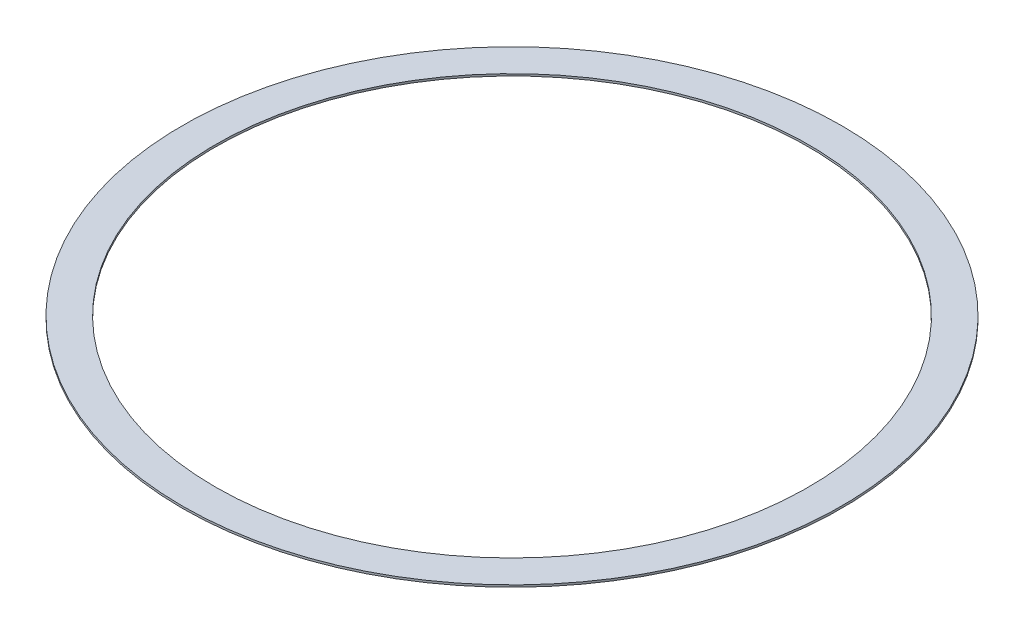
ISO-10303-21;
HEADER;
FILE_DESCRIPTION(('STEP AP214'),'2;1');
FILE_NAME('part.step','',(''),(''),'','','');
FILE_SCHEMA(('AUTOMOTIVE_DESIGN { 1 0 10303 214 1 1 1 1 }'));
ENDSEC;
DATA;
#1=APPLICATION_CONTEXT('core data for automotive mechanical design processes');
#2=APPLICATION_PROTOCOL_DEFINITION('international standard','automotive_design',2000,#1);
#3=PRODUCT_CONTEXT('',#1,'mechanical');
#4=PRODUCT('Part','Part','',(#3));
#5=PRODUCT_RELATED_PRODUCT_CATEGORY('part','',(#4));
#6=PRODUCT_DEFINITION_FORMATION('','',#4);
#7=PRODUCT_DEFINITION_CONTEXT('part definition',#1,'design');
#8=PRODUCT_DEFINITION('design','',#6,#7);
#9=PRODUCT_DEFINITION_SHAPE('','',#8);
#10=(LENGTH_UNIT() NAMED_UNIT(*) SI_UNIT(.MILLI.,.METRE.));
#11=(NAMED_UNIT(*) PLANE_ANGLE_UNIT() SI_UNIT($,.RADIAN.));
#12=(NAMED_UNIT(*) SI_UNIT($,.STERADIAN.) SOLID_ANGLE_UNIT());
#13=UNCERTAINTY_MEASURE_WITH_UNIT(LENGTH_MEASURE(1.E-05),#10,'distance_accuracy_value','');
#14=(GEOMETRIC_REPRESENTATION_CONTEXT(3) GLOBAL_UNCERTAINTY_ASSIGNED_CONTEXT((#13)) GLOBAL_UNIT_ASSIGNED_CONTEXT((#10,
#11,#12)) REPRESENTATION_CONTEXT('',''));
#15=CARTESIAN_POINT('',(0.,0.,0.));
#16=DIRECTION('',(0.,0.,1.));
#17=DIRECTION('',(1.,0.,0.));
#18=AXIS2_PLACEMENT_3D('',#15,#16,#17);
#19=CARTESIAN_POINT('',(0.,1.5875,0.));
#20=DIRECTION('',(0.,1.,0.));
#21=DIRECTION('',(0.,0.,1.));
#22=AXIS2_PLACEMENT_3D('',#19,#20,#21);
#23=PLANE('',#22);
#24=CARTESIAN_POINT('',(0.,1.5875,0.));
#25=DIRECTION('',(0.,1.,0.));
#26=DIRECTION('',(0.,0.,1.));
#27=AXIS2_PLACEMENT_3D('',#24,#25,#26);
#28=CIRCLE('',#27,254.);
#29=CARTESIAN_POINT('',(0.,1.5875,254.));
#30=VERTEX_POINT('',#29);
#31=EDGE_CURVE('E10',#30,#30,#28,.T.);
#32=ORIENTED_EDGE('',*,*,#31,.T.);
#33=EDGE_LOOP('',(#32));
#34=FACE_BOUND('',#33,.T.);
#35=CARTESIAN_POINT('',(0.,1.5875,0.));
#36=DIRECTION('',(0.,1.,0.));
#37=DIRECTION('',(0.,0.,1.));
#38=AXIS2_PLACEMENT_3D('',#35,#36,#37);
#39=CIRCLE('',#38,228.6);
#40=CARTESIAN_POINT('',(0.,1.5875,228.6));
#41=VERTEX_POINT('',#40);
#42=EDGE_CURVE('E44',#41,#41,#39,.T.);
#43=ORIENTED_EDGE('',*,*,#42,.F.);
#44=EDGE_LOOP('',(#43));
#45=FACE_BOUND('',#44,.T.);
#46=ADVANCED_FACE('F33',(#34,#45),#23,.T.);
#47=CARTESIAN_POINT('',(0.,0.,0.));
#48=DIRECTION('',(0.,1.,0.));
#49=DIRECTION('',(0.,0.,1.));
#50=AXIS2_PLACEMENT_3D('',#47,#48,#49);
#51=PLANE('',#50);
#52=CARTESIAN_POINT('',(0.,0.,0.));
#53=DIRECTION('',(0.,1.,0.));
#54=DIRECTION('',(0.,0.,1.));
#55=AXIS2_PLACEMENT_3D('',#52,#53,#54);
#56=CIRCLE('',#55,254.);
#57=CARTESIAN_POINT('',(0.,0.,254.));
#58=VERTEX_POINT('',#57);
#59=EDGE_CURVE('E37',#58,#58,#56,.T.);
#60=ORIENTED_EDGE('',*,*,#59,.F.);
#61=EDGE_LOOP('',(#60));
#62=FACE_BOUND('',#61,.T.);
#63=CARTESIAN_POINT('',(0.,0.,0.));
#64=DIRECTION('',(0.,1.,0.));
#65=DIRECTION('',(0.,0.,1.));
#66=AXIS2_PLACEMENT_3D('',#63,#64,#65);
#67=CIRCLE('',#66,228.6);
#68=CARTESIAN_POINT('',(0.,0.,228.6));
#69=VERTEX_POINT('',#68);
#70=EDGE_CURVE('E46',#69,#69,#67,.T.);
#71=ORIENTED_EDGE('',*,*,#70,.T.);
#72=EDGE_LOOP('',(#71));
#73=FACE_BOUND('',#72,.T.);
#74=ADVANCED_FACE('F56',(#62,#73),#51,.F.);
#75=CARTESIAN_POINT('',(0.,1.5875,0.));
#76=DIRECTION('',(0.,-1.,0.));
#77=DIRECTION('',(0.,0.,-1.));
#78=AXIS2_PLACEMENT_3D('',#75,#76,#77);
#79=CYLINDRICAL_SURFACE('',#78,254.);
#80=ORIENTED_EDGE('',*,*,#31,.F.);
#81=EDGE_LOOP('',(#80));
#82=FACE_BOUND('',#81,.T.);
#83=ORIENTED_EDGE('',*,*,#59,.T.);
#84=EDGE_LOOP('',(#83));
#85=FACE_BOUND('',#84,.T.);
#86=ADVANCED_FACE('F35',(#82,#85),#79,.T.);
#87=CARTESIAN_POINT('',(0.,1.5875,0.));
#88=DIRECTION('',(0.,-1.,0.));
#89=DIRECTION('',(0.,0.,-1.));
#90=AXIS2_PLACEMENT_3D('',#87,#88,#89);
#91=CYLINDRICAL_SURFACE('',#90,228.6);
#92=ORIENTED_EDGE('',*,*,#42,.T.);
#93=EDGE_LOOP('',(#92));
#94=FACE_BOUND('',#93,.T.);
#95=ORIENTED_EDGE('',*,*,#70,.F.);
#96=EDGE_LOOP('',(#95));
#97=FACE_BOUND('',#96,.T.);
#98=ADVANCED_FACE('F52',(#94,#97),#91,.F.);
#99=CLOSED_SHELL('',(#46,#74,#86,#98));
#100=MANIFOLD_SOLID_BREP('B2',#99);
#101=ADVANCED_BREP_SHAPE_REPRESENTATION('',(#18,#100),#14);
#102=SHAPE_DEFINITION_REPRESENTATION(#9,#101);
ENDSEC;
END-ISO-10303-21;
